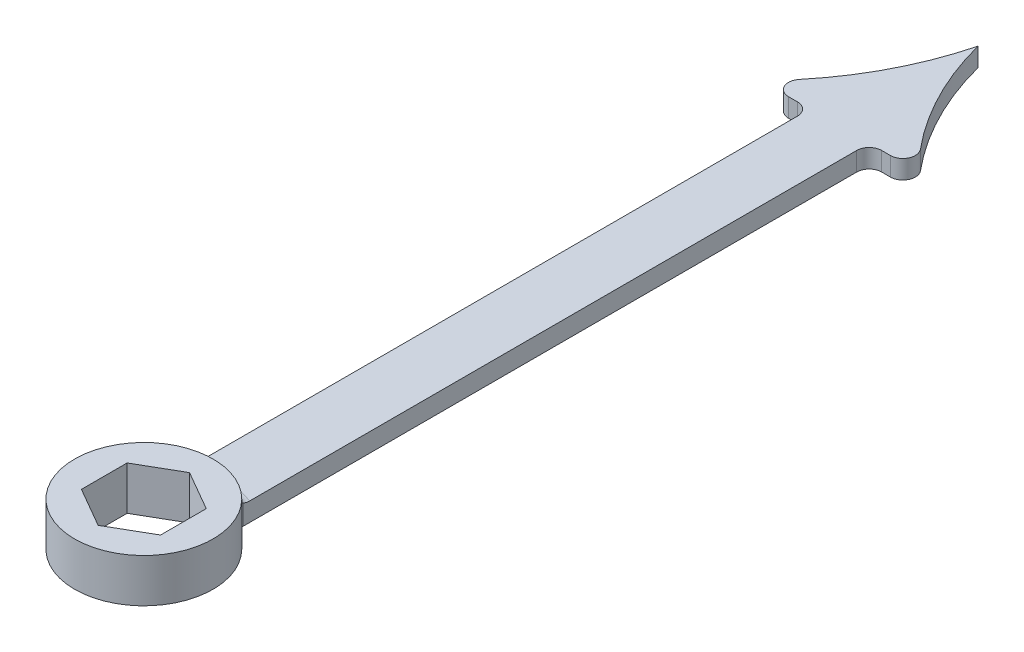
ISO-10303-21;
HEADER;
FILE_DESCRIPTION(('STEP AP214'),'2;1');
FILE_NAME('part.step','',(''),(''),'','','');
FILE_SCHEMA(('AUTOMOTIVE_DESIGN { 1 0 10303 214 1 1 1 1 }'));
ENDSEC;
DATA;
#1=APPLICATION_CONTEXT('core data for automotive mechanical design processes');
#2=APPLICATION_PROTOCOL_DEFINITION('international standard','automotive_design',2000,#1);
#3=PRODUCT_CONTEXT('',#1,'mechanical');
#4=PRODUCT('Part','Part','',(#3));
#5=PRODUCT_RELATED_PRODUCT_CATEGORY('part','',(#4));
#6=PRODUCT_DEFINITION_FORMATION('','',#4);
#7=PRODUCT_DEFINITION_CONTEXT('part definition',#1,'design');
#8=PRODUCT_DEFINITION('design','',#6,#7);
#9=PRODUCT_DEFINITION_SHAPE('','',#8);
#10=(LENGTH_UNIT() NAMED_UNIT(*) SI_UNIT(.MILLI.,.METRE.));
#11=(NAMED_UNIT(*) PLANE_ANGLE_UNIT() SI_UNIT($,.RADIAN.));
#12=(NAMED_UNIT(*) SI_UNIT($,.STERADIAN.) SOLID_ANGLE_UNIT());
#13=UNCERTAINTY_MEASURE_WITH_UNIT(LENGTH_MEASURE(1.E-05),#10,'distance_accuracy_value','');
#14=(GEOMETRIC_REPRESENTATION_CONTEXT(3) GLOBAL_UNCERTAINTY_ASSIGNED_CONTEXT((#13)) GLOBAL_UNIT_ASSIGNED_CONTEXT((#10,
#11,#12)) REPRESENTATION_CONTEXT('',''));
#15=CARTESIAN_POINT('',(0.,0.,0.));
#16=DIRECTION('',(0.,0.,1.));
#17=DIRECTION('',(1.,0.,0.));
#18=AXIS2_PLACEMENT_3D('',#15,#16,#17);
#19=CARTESIAN_POINT('',(0.,7.,0.));
#20=DIRECTION('',(0.,-1.,0.));
#21=DIRECTION('',(0.,0.,-1.));
#22=AXIS2_PLACEMENT_3D('',#19,#20,#21);
#23=CYLINDRICAL_SURFACE('',#22,11.1125);
#24=CARTESIAN_POINT('',(0.,7.,0.));
#25=DIRECTION('',(0.,1.,0.));
#26=DIRECTION('',(0.,0.,1.));
#27=AXIS2_PLACEMENT_3D('',#24,#25,#26);
#28=CIRCLE('',#27,11.1125);
#29=CARTESIAN_POINT('',(0.,7.,11.1125));
#30=VERTEX_POINT('',#29);
#31=EDGE_CURVE('E277',#30,#30,#28,.T.);
#32=ORIENTED_EDGE('',*,*,#31,.F.);
#33=EDGE_LOOP('',(#32));
#34=FACE_BOUND('',#33,.T.);
#35=CARTESIAN_POINT('',(0.,0.,0.));
#36=DIRECTION('',(0.,1.,0.));
#37=DIRECTION('',(0.,0.,1.));
#38=AXIS2_PLACEMENT_3D('',#35,#36,#37);
#39=CIRCLE('',#38,11.1125);
#40=CARTESIAN_POINT('',(-5.73104146806483,0.,-9.52065228549606));
#41=VERTEX_POINT('',#40);
#42=CARTESIAN_POINT('',(5.73104146806483,0.,-9.52065228549606));
#43=VERTEX_POINT('',#42);
#44=EDGE_CURVE('E276',#41,#43,#39,.T.);
#45=ORIENTED_EDGE('',*,*,#44,.T.);
#46=DIRECTION('',(0.,-1.,0.));
#47=VECTOR('',#46,1.);
#48=CARTESIAN_POINT('',(5.73104146806483,7.,-9.52065228549606));
#49=LINE('',#48,#47);
#50=CARTESIAN_POINT('',(5.73104146806483,5.,-9.52065228549606));
#51=VERTEX_POINT('',#50);
#52=EDGE_CURVE('E315',#43,#51,#49,.F.);
#53=ORIENTED_EDGE('',*,*,#52,.T.);
#54=CARTESIAN_POINT('',(0.,5.,0.));
#55=DIRECTION('',(0.,-1.,0.));
#56=DIRECTION('',(0.,0.,-1.));
#57=AXIS2_PLACEMENT_3D('',#54,#55,#56);
#58=CIRCLE('',#57,11.1125);
#59=CARTESIAN_POINT('',(-5.73104146806483,5.,-9.52065228549606));
#60=VERTEX_POINT('',#59);
#61=EDGE_CURVE('E313',#51,#60,#58,.F.);
#62=ORIENTED_EDGE('',*,*,#61,.T.);
#63=DIRECTION('',(0.,-1.,0.));
#64=VECTOR('',#63,1.);
#65=CARTESIAN_POINT('',(-5.73104146806483,7.,-9.52065228549606));
#66=LINE('',#65,#64);
#67=EDGE_CURVE('E311',#60,#41,#66,.T.);
#68=ORIENTED_EDGE('',*,*,#67,.T.);
#69=EDGE_LOOP('',(#45,#53,#62,#68));
#70=FACE_BOUND('',#69,.T.);
#71=ADVANCED_FACE('F37',(#34,#70),#23,.T.);
#72=CARTESIAN_POINT('',(0.,7.,0.));
#73=DIRECTION('',(0.,1.,0.));
#74=DIRECTION('',(0.,0.,1.));
#75=AXIS2_PLACEMENT_3D('',#72,#73,#74);
#76=PLANE('',#75);
#77=ORIENTED_EDGE('',*,*,#31,.T.);
#78=EDGE_LOOP('',(#77));
#79=FACE_BOUND('',#78,.T.);
#80=DIRECTION('',(-0.866025403784439,0.,-0.5));
#81=VECTOR('',#80,1.);
#82=CARTESIAN_POINT('',(6.35,7.,-3.66617420935412));
#83=LINE('',#82,#81);
#84=CARTESIAN_POINT('',(6.35,7.,-3.66617420935412));
#85=VERTEX_POINT('',#84);
#86=CARTESIAN_POINT('',(0.,7.,-7.33234841870825));
#87=VERTEX_POINT('',#86);
#88=EDGE_CURVE('E234',#85,#87,#83,.T.);
#89=ORIENTED_EDGE('',*,*,#88,.F.);
#90=DIRECTION('',(0.,0.,-1.));
#91=VECTOR('',#90,1.);
#92=CARTESIAN_POINT('',(6.35,7.,3.66617420935413));
#93=LINE('',#92,#91);
#94=CARTESIAN_POINT('',(6.35,7.,3.66617420935413));
#95=VERTEX_POINT('',#94);
#96=EDGE_CURVE('E232',#95,#85,#93,.T.);
#97=ORIENTED_EDGE('',*,*,#96,.F.);
#98=DIRECTION('',(0.866025403784439,0.,-0.5));
#99=VECTOR('',#98,1.);
#100=CARTESIAN_POINT('',(0.,7.,7.33234841870825));
#101=LINE('',#100,#99);
#102=CARTESIAN_POINT('',(0.,7.,7.33234841870825));
#103=VERTEX_POINT('',#102);
#104=EDGE_CURVE('E244',#103,#95,#101,.T.);
#105=ORIENTED_EDGE('',*,*,#104,.F.);
#106=DIRECTION('',(0.866025403784438,0.,0.5));
#107=VECTOR('',#106,1.);
#108=CARTESIAN_POINT('',(-6.35,7.,3.66617420935412));
#109=LINE('',#108,#107);
#110=CARTESIAN_POINT('',(-6.35,7.,3.66617420935412));
#111=VERTEX_POINT('',#110);
#112=EDGE_CURVE('E241',#111,#103,#109,.T.);
#113=ORIENTED_EDGE('',*,*,#112,.F.);
#114=DIRECTION('',(0.,0.,1.));
#115=VECTOR('',#114,1.);
#116=CARTESIAN_POINT('',(-6.35,7.,-3.66617420935413));
#117=LINE('',#116,#115);
#118=CARTESIAN_POINT('',(-6.35,7.,-3.66617420935413));
#119=VERTEX_POINT('',#118);
#120=EDGE_CURVE('E239',#119,#111,#117,.T.);
#121=ORIENTED_EDGE('',*,*,#120,.F.);
#122=DIRECTION('',(-0.866025403784439,0.,0.5));
#123=VECTOR('',#122,1.);
#124=CARTESIAN_POINT('',(0.,7.,-7.33234841870825));
#125=LINE('',#124,#123);
#126=EDGE_CURVE('E237',#87,#119,#125,.T.);
#127=ORIENTED_EDGE('',*,*,#126,.F.);
#128=EDGE_LOOP('',(#89,#97,#105,#113,#121,#127));
#129=FACE_BOUND('',#128,.T.);
#130=ADVANCED_FACE('F419',(#79,#129),#76,.T.);
#131=CARTESIAN_POINT('',(0.,0.,0.));
#132=DIRECTION('',(0.,1.,0.));
#133=DIRECTION('',(0.,0.,1.));
#134=AXIS2_PLACEMENT_3D('',#131,#132,#133);
#135=PLANE('',#134);
#136=DIRECTION('',(1.,0.,0.));
#137=VECTOR('',#136,1.);
#138=CARTESIAN_POINT('',(-4.7625,0.,-111.640231571035));
#139=LINE('',#138,#137);
#140=CARTESIAN_POINT('',(-8.16989211177416,0.,-111.640231571035));
#141=VERTEX_POINT('',#140);
#142=CARTESIAN_POINT('',(-6.7625,0.,-111.640231571035));
#143=VERTEX_POINT('',#142);
#144=EDGE_CURVE('E228',#141,#143,#139,.T.);
#145=ORIENTED_EDGE('',*,*,#144,.F.);
#146=CARTESIAN_POINT('',(-8.16989211177416,0.,-113.640231571035));
#147=DIRECTION('',(0.,1.,0.));
#148=DIRECTION('',(0.,0.,1.));
#149=AXIS2_PLACEMENT_3D('',#146,#147,#148);
#150=CIRCLE('',#149,2.);
#151=CARTESIAN_POINT('',(-9.70715885046328,0.,-114.919610707225));
#152=VERTEX_POINT('',#151);
#153=EDGE_CURVE('E289',#141,#152,#150,.F.);
#154=ORIENTED_EDGE('',*,*,#153,.T.);
#155=CARTESIAN_POINT('',(-47.0958333333334,0.,-146.036064904368));
#156=DIRECTION('',(0.,-1.,0.));
#157=DIRECTION('',(0.,0.,1.));
#158=AXIS2_PLACEMENT_3D('',#155,#156,#157);
#159=CIRCLE('',#158,48.6430539891246);
#160=CARTESIAN_POINT('',(0.,0.,-133.865231571035));
#161=VERTEX_POINT('',#160);
#162=EDGE_CURVE('E226',#161,#152,#159,.T.);
#163=ORIENTED_EDGE('',*,*,#162,.F.);
#164=CARTESIAN_POINT('',(47.0958333333334,0.,-146.036064904368));
#165=DIRECTION('',(0.,-1.,0.));
#166=DIRECTION('',(0.,0.,-1.));
#167=AXIS2_PLACEMENT_3D('',#164,#165,#166);
#168=CIRCLE('',#167,48.6430539891246);
#169=CARTESIAN_POINT('',(9.70715885046329,0.,-114.919610707225));
#170=VERTEX_POINT('',#169);
#171=EDGE_CURVE('E200',#170,#161,#168,.T.);
#172=ORIENTED_EDGE('',*,*,#171,.F.);
#173=CARTESIAN_POINT('',(8.16989211177417,0.,-113.640231571035));
#174=DIRECTION('',(0.,1.,0.));
#175=DIRECTION('',(0.,0.,1.));
#176=AXIS2_PLACEMENT_3D('',#173,#174,#175);
#177=CIRCLE('',#176,2.);
#178=CARTESIAN_POINT('',(8.16989211177417,0.,-111.640231571035));
#179=VERTEX_POINT('',#178);
#180=EDGE_CURVE('E287',#170,#179,#177,.F.);
#181=ORIENTED_EDGE('',*,*,#180,.T.);
#182=DIRECTION('',(1.,0.,0.));
#183=VECTOR('',#182,1.);
#184=CARTESIAN_POINT('',(12.7,0.,-111.640231571035));
#185=LINE('',#184,#183);
#186=CARTESIAN_POINT('',(6.7625,0.,-111.640231571035));
#187=VERTEX_POINT('',#186);
#188=EDGE_CURVE('E222',#187,#179,#185,.T.);
#189=ORIENTED_EDGE('',*,*,#188,.F.);
#190=CARTESIAN_POINT('',(6.7625,0.,-109.640231571035));
#191=DIRECTION('',(0.,1.,0.));
#192=DIRECTION('',(0.,0.,1.));
#193=AXIS2_PLACEMENT_3D('',#190,#191,#192);
#194=CIRCLE('',#193,2.);
#195=CARTESIAN_POINT('',(4.7625,0.,-109.640231571035));
#196=VERTEX_POINT('',#195);
#197=EDGE_CURVE('E317',#187,#196,#194,.T.);
#198=ORIENTED_EDGE('',*,*,#197,.T.);
#199=DIRECTION('',(0.,0.,-1.));
#200=VECTOR('',#199,1.);
#201=CARTESIAN_POINT('',(4.7625,0.,-111.640231571035));
#202=LINE('',#201,#200);
#203=CARTESIAN_POINT('',(4.76250000000001,0.,-11.2341555089824));
#204=VERTEX_POINT('',#203);
#205=EDGE_CURVE('E218',#204,#196,#202,.T.);
#206=ORIENTED_EDGE('',*,*,#205,.F.);
#207=CARTESIAN_POINT('',(6.76250000000001,0.,-11.2341555089824));
#208=DIRECTION('',(0.,1.,0.));
#209=DIRECTION('',(0.,0.,1.));
#210=AXIS2_PLACEMENT_3D('',#207,#208,#209);
#211=CIRCLE('',#210,2.);
#212=EDGE_CURVE('E325',#204,#43,#211,.T.);
#213=ORIENTED_EDGE('',*,*,#212,.T.);
#214=ORIENTED_EDGE('',*,*,#44,.F.);
#215=CARTESIAN_POINT('',(-6.76250000000001,0.,-11.2341555089824));
#216=DIRECTION('',(0.,1.,0.));
#217=DIRECTION('',(0.,0.,1.));
#218=AXIS2_PLACEMENT_3D('',#215,#216,#217);
#219=CIRCLE('',#218,2.);
#220=CARTESIAN_POINT('',(-4.76250000000001,0.,-11.2341555089824));
#221=VERTEX_POINT('',#220);
#222=EDGE_CURVE('E11',#41,#221,#219,.T.);
#223=ORIENTED_EDGE('',*,*,#222,.T.);
#224=DIRECTION('',(0.,0.,1.));
#225=VECTOR('',#224,1.);
#226=CARTESIAN_POINT('',(-4.7625,0.,-111.640231571035));
#227=LINE('',#226,#225);
#228=CARTESIAN_POINT('',(-4.7625,0.,-109.640231571035));
#229=VERTEX_POINT('',#228);
#230=EDGE_CURVE('E215',#229,#221,#227,.T.);
#231=ORIENTED_EDGE('',*,*,#230,.F.);
#232=CARTESIAN_POINT('',(-6.7625,0.,-109.640231571035));
#233=DIRECTION('',(0.,1.,0.));
#234=DIRECTION('',(0.,0.,1.));
#235=AXIS2_PLACEMENT_3D('',#232,#233,#234);
#236=CIRCLE('',#235,2.);
#237=EDGE_CURVE('E321',#229,#143,#236,.T.);
#238=ORIENTED_EDGE('',*,*,#237,.T.);
#239=EDGE_LOOP('',(#145,#154,#163,#172,#181,#189,#198,#206,#213,#214,#223,#231,#238));
#240=FACE_BOUND('',#239,.T.);
#241=DIRECTION('',(0.,0.,-1.));
#242=VECTOR('',#241,1.);
#243=CARTESIAN_POINT('',(6.35,0.,3.66617420935413));
#244=LINE('',#243,#242);
#245=CARTESIAN_POINT('',(6.35,0.,3.66617420935413));
#246=VERTEX_POINT('',#245);
#247=CARTESIAN_POINT('',(6.35,0.,-3.66617420935412));
#248=VERTEX_POINT('',#247);
#249=EDGE_CURVE('E204',#246,#248,#244,.T.);
#250=ORIENTED_EDGE('',*,*,#249,.T.);
#251=DIRECTION('',(-0.866025403784439,0.,-0.5));
#252=VECTOR('',#251,1.);
#253=CARTESIAN_POINT('',(6.35,0.,-3.66617420935412));
#254=LINE('',#253,#252);
#255=CARTESIAN_POINT('',(0.,0.,-7.33234841870825));
#256=VERTEX_POINT('',#255);
#257=EDGE_CURVE('E249',#248,#256,#254,.T.);
#258=ORIENTED_EDGE('',*,*,#257,.T.);
#259=DIRECTION('',(-0.866025403784439,0.,0.5));
#260=VECTOR('',#259,1.);
#261=CARTESIAN_POINT('',(0.,0.,-7.33234841870825));
#262=LINE('',#261,#260);
#263=CARTESIAN_POINT('',(-6.35,0.,-3.66617420935413));
#264=VERTEX_POINT('',#263);
#265=EDGE_CURVE('E252',#256,#264,#262,.T.);
#266=ORIENTED_EDGE('',*,*,#265,.T.);
#267=DIRECTION('',(0.,0.,1.));
#268=VECTOR('',#267,1.);
#269=CARTESIAN_POINT('',(-6.35,0.,-3.66617420935413));
#270=LINE('',#269,#268);
#271=CARTESIAN_POINT('',(-6.35,0.,3.66617420935412));
#272=VERTEX_POINT('',#271);
#273=EDGE_CURVE('E255',#264,#272,#270,.T.);
#274=ORIENTED_EDGE('',*,*,#273,.T.);
#275=DIRECTION('',(0.866025403784438,0.,0.5));
#276=VECTOR('',#275,1.);
#277=CARTESIAN_POINT('',(-6.35,0.,3.66617420935412));
#278=LINE('',#277,#276);
#279=CARTESIAN_POINT('',(0.,0.,7.33234841870825));
#280=VERTEX_POINT('',#279);
#281=EDGE_CURVE('E258',#272,#280,#278,.T.);
#282=ORIENTED_EDGE('',*,*,#281,.T.);
#283=DIRECTION('',(0.866025403784439,0.,-0.5));
#284=VECTOR('',#283,1.);
#285=CARTESIAN_POINT('',(0.,0.,7.33234841870825));
#286=LINE('',#285,#284);
#287=EDGE_CURVE('E235',#280,#246,#286,.T.);
#288=ORIENTED_EDGE('',*,*,#287,.T.);
#289=EDGE_LOOP('',(#250,#258,#266,#274,#282,#288));
#290=FACE_BOUND('',#289,.T.);
#291=ADVANCED_FACE('F371',(#240,#290),#135,.F.);
#292=CARTESIAN_POINT('',(6.35,7.,3.66617420935413));
#293=DIRECTION('',(-1.,0.,0.));
#294=DIRECTION('',(0.,0.,1.));
#295=AXIS2_PLACEMENT_3D('',#292,#293,#294);
#296=PLANE('',#295);
#297=ORIENTED_EDGE('',*,*,#249,.F.);
#298=DIRECTION('',(0.,-1.,0.));
#299=VECTOR('',#298,1.);
#300=CARTESIAN_POINT('',(6.35,7.,3.66617420935413));
#301=LINE('',#300,#299);
#302=EDGE_CURVE('E246',#95,#246,#301,.T.);
#303=ORIENTED_EDGE('',*,*,#302,.F.);
#304=ORIENTED_EDGE('',*,*,#96,.T.);
#305=DIRECTION('',(0.,-1.,0.));
#306=VECTOR('',#305,1.);
#307=CARTESIAN_POINT('',(6.35,7.,-3.66617420935412));
#308=LINE('',#307,#306);
#309=EDGE_CURVE('E273',#85,#248,#308,.T.);
#310=ORIENTED_EDGE('',*,*,#309,.T.);
#311=EDGE_LOOP('',(#297,#303,#304,#310));
#312=FACE_BOUND('',#311,.T.);
#313=ADVANCED_FACE('F531',(#312),#296,.T.);
#314=CARTESIAN_POINT('',(6.35,7.,-3.66617420935412));
#315=DIRECTION('',(-0.5,0.,0.866025403784439));
#316=DIRECTION('',(0.866025403784439,0.,0.5));
#317=AXIS2_PLACEMENT_3D('',#314,#315,#316);
#318=PLANE('',#317);
#319=ORIENTED_EDGE('',*,*,#257,.F.);
#320=ORIENTED_EDGE('',*,*,#309,.F.);
#321=ORIENTED_EDGE('',*,*,#88,.T.);
#322=DIRECTION('',(0.,-1.,0.));
#323=VECTOR('',#322,1.);
#324=CARTESIAN_POINT('',(0.,7.,-7.33234841870825));
#325=LINE('',#324,#323);
#326=EDGE_CURVE('E271',#87,#256,#325,.T.);
#327=ORIENTED_EDGE('',*,*,#326,.T.);
#328=EDGE_LOOP('',(#319,#320,#321,#327));
#329=FACE_BOUND('',#328,.T.);
#330=ADVANCED_FACE('F570',(#329),#318,.T.);
#331=CARTESIAN_POINT('',(0.,7.,-7.33234841870825));
#332=DIRECTION('',(0.5,0.,0.866025403784439));
#333=DIRECTION('',(0.866025403784439,0.,-0.5));
#334=AXIS2_PLACEMENT_3D('',#331,#332,#333);
#335=PLANE('',#334);
#336=ORIENTED_EDGE('',*,*,#265,.F.);
#337=ORIENTED_EDGE('',*,*,#326,.F.);
#338=ORIENTED_EDGE('',*,*,#126,.T.);
#339=DIRECTION('',(0.,-1.,0.));
#340=VECTOR('',#339,1.);
#341=CARTESIAN_POINT('',(-6.35,7.,-3.66617420935413));
#342=LINE('',#341,#340);
#343=EDGE_CURVE('E269',#119,#264,#342,.T.);
#344=ORIENTED_EDGE('',*,*,#343,.T.);
#345=EDGE_LOOP('',(#336,#337,#338,#344));
#346=FACE_BOUND('',#345,.T.);
#347=ADVANCED_FACE('F561',(#346),#335,.T.);
#348=CARTESIAN_POINT('',(-6.35,7.,-3.66617420935413));
#349=DIRECTION('',(1.,0.,0.));
#350=DIRECTION('',(0.,0.,-1.));
#351=AXIS2_PLACEMENT_3D('',#348,#349,#350);
#352=PLANE('',#351);
#353=ORIENTED_EDGE('',*,*,#273,.F.);
#354=ORIENTED_EDGE('',*,*,#343,.F.);
#355=ORIENTED_EDGE('',*,*,#120,.T.);
#356=DIRECTION('',(0.,-1.,0.));
#357=VECTOR('',#356,1.);
#358=CARTESIAN_POINT('',(-6.35,7.,3.66617420935412));
#359=LINE('',#358,#357);
#360=EDGE_CURVE('E267',#111,#272,#359,.T.);
#361=ORIENTED_EDGE('',*,*,#360,.T.);
#362=EDGE_LOOP('',(#353,#354,#355,#361));
#363=FACE_BOUND('',#362,.T.);
#364=ADVANCED_FACE('F552',(#363),#352,.T.);
#365=CARTESIAN_POINT('',(-6.35,7.,3.66617420935412));
#366=DIRECTION('',(0.5,0.,-0.866025403784438));
#367=DIRECTION('',(-0.866025403784439,0.,-0.5));
#368=AXIS2_PLACEMENT_3D('',#365,#366,#367);
#369=PLANE('',#368);
#370=ORIENTED_EDGE('',*,*,#281,.F.);
#371=ORIENTED_EDGE('',*,*,#360,.F.);
#372=ORIENTED_EDGE('',*,*,#112,.T.);
#373=DIRECTION('',(0.,-1.,0.));
#374=VECTOR('',#373,1.);
#375=CARTESIAN_POINT('',(0.,7.,7.33234841870825));
#376=LINE('',#375,#374);
#377=EDGE_CURVE('E265',#103,#280,#376,.T.);
#378=ORIENTED_EDGE('',*,*,#377,.T.);
#379=EDGE_LOOP('',(#370,#371,#372,#378));
#380=FACE_BOUND('',#379,.T.);
#381=ADVANCED_FACE('F414',(#380),#369,.T.);
#382=CARTESIAN_POINT('',(0.,7.,7.33234841870825));
#383=DIRECTION('',(-0.5,0.,-0.866025403784439));
#384=DIRECTION('',(-0.866025403784439,0.,0.5));
#385=AXIS2_PLACEMENT_3D('',#382,#383,#384);
#386=PLANE('',#385);
#387=ORIENTED_EDGE('',*,*,#287,.F.);
#388=ORIENTED_EDGE('',*,*,#377,.F.);
#389=ORIENTED_EDGE('',*,*,#104,.T.);
#390=ORIENTED_EDGE('',*,*,#302,.T.);
#391=EDGE_LOOP('',(#387,#388,#389,#390));
#392=FACE_BOUND('',#391,.T.);
#393=ADVANCED_FACE('F408',(#392),#386,.T.);
#394=CARTESIAN_POINT('',(-4.7625,3.,-111.640231571035));
#395=DIRECTION('',(1.,0.,0.));
#396=DIRECTION('',(0.,0.,-1.));
#397=AXIS2_PLACEMENT_3D('',#394,#395,#396);
#398=PLANE('',#397);
#399=DIRECTION('',(0.,0.,1.));
#400=VECTOR('',#399,1.);
#401=CARTESIAN_POINT('',(-4.7625,3.,-111.640231571035));
#402=LINE('',#401,#400);
#403=CARTESIAN_POINT('',(-4.7625,3.,-109.640231571035));
#404=VERTEX_POINT('',#403);
#405=CARTESIAN_POINT('',(-4.76250000000001,3.,-12.2170475156643));
#406=VERTEX_POINT('',#405);
#407=EDGE_CURVE('E230',#404,#406,#402,.T.);
#408=ORIENTED_EDGE('',*,*,#407,.F.);
#409=DIRECTION('',(0.,-1.,0.));
#410=VECTOR('',#409,1.);
#411=CARTESIAN_POINT('',(-4.7625,0.,-109.640231571035));
#412=LINE('',#411,#410);
#413=EDGE_CURVE('E308',#404,#229,#412,.T.);
#414=ORIENTED_EDGE('',*,*,#413,.T.);
#415=ORIENTED_EDGE('',*,*,#230,.T.);
#416=DIRECTION('',(0.,1.,0.));
#417=VECTOR('',#416,1.);
#418=CARTESIAN_POINT('',(-4.76250000000001,3.,-11.2341555089824));
#419=LINE('',#418,#417);
#420=CARTESIAN_POINT('',(-4.76250000000001,3.21929673899231,-11.2341555089824));
#421=VERTEX_POINT('',#420);
#422=EDGE_CURVE('E59',#221,#421,#419,.T.);
#423=ORIENTED_EDGE('',*,*,#422,.T.);
#424=CARTESIAN_POINT('',(-4.76250000000001,3.21929673899231,-11.2341555089824));
#425=CARTESIAN_POINT('',(-4.76250000000001,3.1914096548871,-11.2934044567039));
#426=CARTESIAN_POINT('',(-4.76250000000001,3.16609121998151,-11.3538197357716));
#427=CARTESIAN_POINT('',(-4.76250000000001,3.12069964349236,-11.4765963763193));
#428=CARTESIAN_POINT('',(-4.76250000000001,3.10062697968031,-11.538957914481));
#429=CARTESIAN_POINT('',(-4.76250000000001,3.04910814252754,-11.725964070257));
#430=CARTESIAN_POINT('',(-4.76250000000001,3.02529585007529,-11.8528148668332));
#431=CARTESIAN_POINT('',(-4.76250000000001,3.00404156504719,-12.0592370611826));
#432=CARTESIAN_POINT('',(-4.76250000000001,2.9999721340328,-12.1381805718689));
#433=CARTESIAN_POINT('',(-4.76250000000001,3.,-12.2170475156643));
#434=B_SPLINE_CURVE_WITH_KNOTS('',3,(#424,#425,#426,#427,#428,#429,#430,#431,#432,#433),
.UNSPECIFIED.,.F.,.F.,(4,2,2,2,4),(0.,0.196315726662677,0.392649327037512,0.777849154855152,
1.01453335750729),.UNSPECIFIED.);
#435=EDGE_CURVE('E51',#421,#406,#434,.T.);
#436=ORIENTED_EDGE('',*,*,#435,.T.);
#437=EDGE_LOOP('',(#408,#414,#415,#423,#436));
#438=FACE_BOUND('',#437,.T.);
#439=ADVANCED_FACE('F406',(#438),#398,.F.);
#440=CARTESIAN_POINT('',(4.7625,3.,-111.640231571035));
#441=DIRECTION('',(-1.,0.,0.));
#442=DIRECTION('',(0.,0.,1.));
#443=AXIS2_PLACEMENT_3D('',#440,#441,#442);
#444=PLANE('',#443);
#445=ORIENTED_EDGE('',*,*,#205,.T.);
#446=DIRECTION('',(0.,-1.,0.));
#447=VECTOR('',#446,1.);
#448=CARTESIAN_POINT('',(4.7625,3.,-109.640231571035));
#449=LINE('',#448,#447);
#450=CARTESIAN_POINT('',(4.7625,3.,-109.640231571035));
#451=VERTEX_POINT('',#450);
#452=EDGE_CURVE('E305',#196,#451,#449,.F.);
#453=ORIENTED_EDGE('',*,*,#452,.T.);
#454=DIRECTION('',(0.,0.,-1.));
#455=VECTOR('',#454,1.);
#456=CARTESIAN_POINT('',(4.7625,3.,-111.640231571035));
#457=LINE('',#456,#455);
#458=CARTESIAN_POINT('',(4.76250000000001,3.,-12.2170475156643));
#459=VERTEX_POINT('',#458);
#460=EDGE_CURVE('E380',#459,#451,#457,.T.);
#461=ORIENTED_EDGE('',*,*,#460,.F.);
#462=CARTESIAN_POINT('',(4.76250000000001,3.,-12.2170475156643));
#463=CARTESIAN_POINT('',(4.76250000000001,3.00000646734998,-12.1515698078484));
#464=CARTESIAN_POINT('',(4.76250000000001,3.00279369054526,-12.0861405231735));
#465=CARTESIAN_POINT('',(4.76250000000001,3.01389966317298,-11.9557170658602));
#466=CARTESIAN_POINT('',(4.76250000000001,3.02222143537952,-11.8907231506095));
#467=CARTESIAN_POINT('',(4.76250000000001,3.0550113916884,-11.6995034250665));
#468=CARTESIAN_POINT('',(4.76250000000001,3.08731100363365,-11.5744815940641));
#469=CARTESIAN_POINT('',(4.76250000000001,3.14271593282629,-11.4160689565287));
#470=CARTESIAN_POINT('',(4.76250000000001,3.15666192605536,-11.3792633454311));
#471=CARTESIAN_POINT('',(4.76250000000001,3.18651705373608,-11.3062144427257));
#472=CARTESIAN_POINT('',(4.76250000000001,3.20243683200571,-11.2699755016664));
#473=CARTESIAN_POINT('',(4.76250000000001,3.21929673899231,-11.2341555089824));
#474=B_SPLINE_CURVE_WITH_KNOTS('',3,(#462,#463,#464,#465,#466,#467,#468,#469,#470,#471,#472,
#473),.UNSPECIFIED.,.F.,.F.,(4,2,2,2,2,4),(0.,0.196278388849445,0.392664066114746,
0.777852160008767,0.89589803817589,1.01461069648536),.UNSPECIFIED.);
#475=CARTESIAN_POINT('',(4.76250000000001,3.21929673899231,-11.2341555089824));
#476=VERTEX_POINT('',#475);
#477=EDGE_CURVE('E327',#459,#476,#474,.T.);
#478=ORIENTED_EDGE('',*,*,#477,.T.);
#479=DIRECTION('',(0.,1.,0.));
#480=VECTOR('',#479,1.);
#481=CARTESIAN_POINT('',(4.76250000000001,0.,-11.2341555089824));
#482=LINE('',#481,#480);
#483=EDGE_CURVE('E67',#476,#204,#482,.F.);
#484=ORIENTED_EDGE('',*,*,#483,.T.);
#485=EDGE_LOOP('',(#445,#453,#461,#478,#484));
#486=FACE_BOUND('',#485,.T.);
#487=ADVANCED_FACE('F339',(#486),#444,.F.);
#488=CARTESIAN_POINT('',(12.7,3.,-111.640231571035));
#489=DIRECTION('',(0.,0.,-1.));
#490=DIRECTION('',(-1.,0.,0.));
#491=AXIS2_PLACEMENT_3D('',#488,#489,#490);
#492=PLANE('',#491);
#493=ORIENTED_EDGE('',*,*,#188,.T.);
#494=DIRECTION('',(0.,-1.,0.));
#495=VECTOR('',#494,1.);
#496=CARTESIAN_POINT('',(8.16989211177417,3.,-111.640231571035));
#497=LINE('',#496,#495);
#498=CARTESIAN_POINT('',(8.16989211177417,3.,-111.640231571035));
#499=VERTEX_POINT('',#498);
#500=EDGE_CURVE('E302',#179,#499,#497,.F.);
#501=ORIENTED_EDGE('',*,*,#500,.T.);
#502=DIRECTION('',(1.,0.,0.));
#503=VECTOR('',#502,1.);
#504=CARTESIAN_POINT('',(12.7,3.,-111.640231571035));
#505=LINE('',#504,#503);
#506=CARTESIAN_POINT('',(6.7625,3.,-111.640231571035));
#507=VERTEX_POINT('',#506);
#508=EDGE_CURVE('E194',#507,#499,#505,.T.);
#509=ORIENTED_EDGE('',*,*,#508,.F.);
#510=DIRECTION('',(0.,-1.,0.));
#511=VECTOR('',#510,1.);
#512=CARTESIAN_POINT('',(6.7625,0.,-111.640231571035));
#513=LINE('',#512,#511);
#514=EDGE_CURVE('E299',#507,#187,#513,.T.);
#515=ORIENTED_EDGE('',*,*,#514,.T.);
#516=EDGE_LOOP('',(#493,#501,#509,#515));
#517=FACE_BOUND('',#516,.T.);
#518=ADVANCED_FACE('F413',(#517),#492,.F.);
#519=CARTESIAN_POINT('',(47.0958333333334,3.,-146.036064904368));
#520=DIRECTION('',(0.,-1.,0.));
#521=DIRECTION('',(0.,0.,-1.));
#522=AXIS2_PLACEMENT_3D('',#519,#520,#521);
#523=CYLINDRICAL_SURFACE('',#522,48.6430539891246);
#524=CARTESIAN_POINT('',(47.0958333333334,3.,-146.036064904368));
#525=DIRECTION('',(0.,-1.,0.));
#526=DIRECTION('',(0.,0.,-1.));
#527=AXIS2_PLACEMENT_3D('',#524,#525,#526);
#528=CIRCLE('',#527,48.6430539891246);
#529=CARTESIAN_POINT('',(9.70715885046329,3.,-114.919610707225));
#530=VERTEX_POINT('',#529);
#531=CARTESIAN_POINT('',(0.,3.,-133.865231571035));
#532=VERTEX_POINT('',#531);
#533=EDGE_CURVE('E182',#530,#532,#528,.T.);
#534=ORIENTED_EDGE('',*,*,#533,.F.);
#535=DIRECTION('',(0.,-1.,0.));
#536=VECTOR('',#535,1.);
#537=CARTESIAN_POINT('',(9.70715885046328,3.,-114.919610707225));
#538=LINE('',#537,#536);
#539=EDGE_CURVE('E297',#530,#170,#538,.T.);
#540=ORIENTED_EDGE('',*,*,#539,.T.);
#541=ORIENTED_EDGE('',*,*,#171,.T.);
#542=DIRECTION('',(0.,-1.,0.));
#543=VECTOR('',#542,1.);
#544=CARTESIAN_POINT('',(0.,3.,-133.865231571035));
#545=LINE('',#544,#543);
#546=EDGE_CURVE('E197',#532,#161,#545,.T.);
#547=ORIENTED_EDGE('',*,*,#546,.F.);
#548=EDGE_LOOP('',(#534,#540,#541,#547));
#549=FACE_BOUND('',#548,.T.);
#550=ADVANCED_FACE('F198',(#549),#523,.F.);
#551=CARTESIAN_POINT('',(-47.0958333333334,3.,-146.036064904368));
#552=DIRECTION('',(0.,-1.,0.));
#553=DIRECTION('',(0.,0.,-1.));
#554=AXIS2_PLACEMENT_3D('',#551,#552,#553);
#555=CYLINDRICAL_SURFACE('',#554,48.6430539891246);
#556=ORIENTED_EDGE('',*,*,#162,.T.);
#557=DIRECTION('',(0.,-1.,0.));
#558=VECTOR('',#557,1.);
#559=CARTESIAN_POINT('',(-9.70715885046328,3.,-114.919610707225));
#560=LINE('',#559,#558);
#561=CARTESIAN_POINT('',(-9.70715885046328,3.,-114.919610707225));
#562=VERTEX_POINT('',#561);
#563=EDGE_CURVE('E209',#152,#562,#560,.F.);
#564=ORIENTED_EDGE('',*,*,#563,.T.);
#565=CARTESIAN_POINT('',(-47.0958333333334,3.,-146.036064904368));
#566=DIRECTION('',(0.,-1.,0.));
#567=DIRECTION('',(0.,0.,1.));
#568=AXIS2_PLACEMENT_3D('',#565,#566,#567);
#569=CIRCLE('',#568,48.6430539891246);
#570=EDGE_CURVE('E186',#532,#562,#569,.T.);
#571=ORIENTED_EDGE('',*,*,#570,.F.);
#572=ORIENTED_EDGE('',*,*,#546,.T.);
#573=EDGE_LOOP('',(#556,#564,#571,#572));
#574=FACE_BOUND('',#573,.T.);
#575=ADVANCED_FACE('F207',(#574),#555,.F.);
#576=CARTESIAN_POINT('',(-4.7625,3.,-111.640231571035));
#577=DIRECTION('',(0.,0.,-1.));
#578=DIRECTION('',(-1.,0.,0.));
#579=AXIS2_PLACEMENT_3D('',#576,#577,#578);
#580=PLANE('',#579);
#581=DIRECTION('',(1.,0.,0.));
#582=VECTOR('',#581,1.);
#583=CARTESIAN_POINT('',(-4.7625,3.,-111.640231571035));
#584=LINE('',#583,#582);
#585=CARTESIAN_POINT('',(-8.16989211177416,3.,-111.640231571035));
#586=VERTEX_POINT('',#585);
#587=CARTESIAN_POINT('',(-6.7625,3.,-111.640231571035));
#588=VERTEX_POINT('',#587);
#589=EDGE_CURVE('E205',#586,#588,#584,.T.);
#590=ORIENTED_EDGE('',*,*,#589,.F.);
#591=DIRECTION('',(0.,-1.,0.));
#592=VECTOR('',#591,1.);
#593=CARTESIAN_POINT('',(-8.16989211177416,3.,-111.640231571035));
#594=LINE('',#593,#592);
#595=EDGE_CURVE('E284',#586,#141,#594,.T.);
#596=ORIENTED_EDGE('',*,*,#595,.T.);
#597=ORIENTED_EDGE('',*,*,#144,.T.);
#598=DIRECTION('',(0.,-1.,0.));
#599=VECTOR('',#598,1.);
#600=CARTESIAN_POINT('',(-6.7625,3.,-111.640231571035));
#601=LINE('',#600,#599);
#602=EDGE_CURVE('E280',#143,#588,#601,.F.);
#603=ORIENTED_EDGE('',*,*,#602,.T.);
#604=EDGE_LOOP('',(#590,#596,#597,#603));
#605=FACE_BOUND('',#604,.T.);
#606=ADVANCED_FACE('F402',(#605),#580,.F.);
#607=CARTESIAN_POINT('',(47.0958333333334,3.,-146.036064904368));
#608=DIRECTION('',(0.,-1.,0.));
#609=DIRECTION('',(0.,0.,-1.));
#610=AXIS2_PLACEMENT_3D('',#607,#608,#609);
#611=PLANE('',#610);
#612=ORIENTED_EDGE('',*,*,#570,.T.);
#613=CARTESIAN_POINT('',(-8.16989211177416,3.,-113.640231571035));
#614=DIRECTION('',(0.,-1.,0.));
#615=DIRECTION('',(0.,0.,-1.));
#616=AXIS2_PLACEMENT_3D('',#613,#614,#615);
#617=CIRCLE('',#616,2.);
#618=EDGE_CURVE('E295',#562,#586,#617,.F.);
#619=ORIENTED_EDGE('',*,*,#618,.T.);
#620=ORIENTED_EDGE('',*,*,#589,.T.);
#621=CARTESIAN_POINT('',(-6.7625,3.,-109.640231571035));
#622=DIRECTION('',(0.,-1.,0.));
#623=DIRECTION('',(0.,0.,-1.));
#624=AXIS2_PLACEMENT_3D('',#621,#622,#623);
#625=CIRCLE('',#624,2.);
#626=EDGE_CURVE('E323',#588,#404,#625,.T.);
#627=ORIENTED_EDGE('',*,*,#626,.T.);
#628=ORIENTED_EDGE('',*,*,#407,.T.);
#629=CARTESIAN_POINT('',(0.,3.,0.));
#630=DIRECTION('',(0.,-1.,0.));
#631=DIRECTION('',(0.,0.,-1.));
#632=AXIS2_PLACEMENT_3D('',#629,#630,#631);
#633=CIRCLE('',#632,13.1125);
#634=EDGE_CURVE('E292',#406,#459,#633,.T.);
#635=ORIENTED_EDGE('',*,*,#634,.T.);
#636=ORIENTED_EDGE('',*,*,#460,.T.);
#637=CARTESIAN_POINT('',(6.7625,3.,-109.640231571035));
#638=DIRECTION('',(0.,-1.,0.));
#639=DIRECTION('',(0.,0.,-1.));
#640=AXIS2_PLACEMENT_3D('',#637,#638,#639);
#641=CIRCLE('',#640,2.);
#642=EDGE_CURVE('E319',#451,#507,#641,.T.);
#643=ORIENTED_EDGE('',*,*,#642,.T.);
#644=ORIENTED_EDGE('',*,*,#508,.T.);
#645=CARTESIAN_POINT('',(8.16989211177417,3.,-113.640231571035));
#646=DIRECTION('',(0.,-1.,0.));
#647=DIRECTION('',(0.,0.,-1.));
#648=AXIS2_PLACEMENT_3D('',#645,#646,#647);
#649=CIRCLE('',#648,2.);
#650=EDGE_CURVE('E190',#499,#530,#649,.F.);
#651=ORIENTED_EDGE('',*,*,#650,.T.);
#652=ORIENTED_EDGE('',*,*,#533,.T.);
#653=EDGE_LOOP('',(#612,#619,#620,#627,#628,#635,#636,#643,#644,#651,#652));
#654=FACE_BOUND('',#653,.T.);
#655=ADVANCED_FACE('F184',(#654),#611,.F.);
#656=CARTESIAN_POINT('',(-8.16989211177416,3.,-113.640231571035));
#657=DIRECTION('',(0.,-1.,0.));
#658=DIRECTION('',(0.,0.,-1.));
#659=AXIS2_PLACEMENT_3D('',#656,#657,#658);
#660=CYLINDRICAL_SURFACE('',#659,2.);
#661=ORIENTED_EDGE('',*,*,#618,.F.);
#662=ORIENTED_EDGE('',*,*,#563,.F.);
#663=ORIENTED_EDGE('',*,*,#153,.F.);
#664=ORIENTED_EDGE('',*,*,#595,.F.);
#665=EDGE_LOOP('',(#661,#662,#663,#664));
#666=FACE_BOUND('',#665,.T.);
#667=ADVANCED_FACE('F398',(#666),#660,.T.);
#668=CARTESIAN_POINT('',(8.16989211177417,3.,-113.640231571035));
#669=DIRECTION('',(0.,-1.,0.));
#670=DIRECTION('',(0.,0.,-1.));
#671=AXIS2_PLACEMENT_3D('',#668,#669,#670);
#672=CYLINDRICAL_SURFACE('',#671,2.);
#673=ORIENTED_EDGE('',*,*,#650,.F.);
#674=ORIENTED_EDGE('',*,*,#500,.F.);
#675=ORIENTED_EDGE('',*,*,#180,.F.);
#676=ORIENTED_EDGE('',*,*,#539,.F.);
#677=EDGE_LOOP('',(#673,#674,#675,#676));
#678=FACE_BOUND('',#677,.T.);
#679=ADVANCED_FACE('F395',(#678),#672,.T.);
#680=CARTESIAN_POINT('',(6.7625,3.,-109.640231571035));
#681=DIRECTION('',(0.,1.,0.));
#682=DIRECTION('',(0.,0.,1.));
#683=AXIS2_PLACEMENT_3D('',#680,#681,#682);
#684=CYLINDRICAL_SURFACE('',#683,2.);
#685=ORIENTED_EDGE('',*,*,#642,.F.);
#686=ORIENTED_EDGE('',*,*,#452,.F.);
#687=ORIENTED_EDGE('',*,*,#197,.F.);
#688=ORIENTED_EDGE('',*,*,#514,.F.);
#689=EDGE_LOOP('',(#685,#686,#687,#688));
#690=FACE_BOUND('',#689,.T.);
#691=ADVANCED_FACE('F434',(#690),#684,.F.);
#692=CARTESIAN_POINT('',(-6.7625,3.,-109.640231571035));
#693=DIRECTION('',(0.,1.,0.));
#694=DIRECTION('',(0.,0.,1.));
#695=AXIS2_PLACEMENT_3D('',#692,#693,#694);
#696=CYLINDRICAL_SURFACE('',#695,2.);
#697=ORIENTED_EDGE('',*,*,#626,.F.);
#698=ORIENTED_EDGE('',*,*,#602,.F.);
#699=ORIENTED_EDGE('',*,*,#237,.F.);
#700=ORIENTED_EDGE('',*,*,#413,.F.);
#701=EDGE_LOOP('',(#697,#698,#699,#700));
#702=FACE_BOUND('',#701,.T.);
#703=ADVANCED_FACE('F405',(#702),#696,.F.);
#704=CARTESIAN_POINT('',(-6.76250000000001,7.,-11.2341555089824));
#705=DIRECTION('',(0.,-1.,0.));
#706=DIRECTION('',(0.,0.,-1.));
#707=AXIS2_PLACEMENT_3D('',#704,#705,#706);
#708=CYLINDRICAL_SURFACE('',#707,2.);
#709=ORIENTED_EDGE('',*,*,#222,.F.);
#710=ORIENTED_EDGE('',*,*,#67,.F.);
#711=CARTESIAN_POINT('',(-4.76250000000001,3.21929673899231,-11.2341555089824));
#712=CARTESIAN_POINT('',(-4.76250480221569,3.24741390815159,-11.1744324759286));
#713=CARTESIAN_POINT('',(-4.76517367273903,3.27765238415035,-11.1158170891528));
#714=CARTESIAN_POINT('',(-4.77528516744353,3.34170391832772,-11.0011653791803));
#715=CARTESIAN_POINT('',(-4.78271686349668,3.37550864592065,-10.9451234658898));
#716=CARTESIAN_POINT('',(-4.8111472098608,3.48073859660176,-10.7821530953974));
#717=CARTESIAN_POINT('',(-4.83830515690336,3.55659708223592,-10.6791141530191));
#718=CARTESIAN_POINT('',(-4.89467035992109,3.69050429536822,-10.5157589083297));
#719=CARTESIAN_POINT('',(-4.92040353594041,3.74642506245966,-10.4523674198256));
#720=CARTESIAN_POINT('',(-4.97696720436933,3.86112218750781,-10.3306228716185));
#721=CARTESIAN_POINT('',(-5.00779880895127,3.91989916653943,-10.2722709154774));
#722=CARTESIAN_POINT('',(-5.10720404673351,4.10000591990742,-10.1040923706717));
#723=CARTESIAN_POINT('',(-5.18248613781451,4.22464798172695,-10.001692040779));
#724=CARTESIAN_POINT('',(-5.33286184429294,4.45660577412979,-9.83176581621024));
#725=CARTESIAN_POINT('',(-5.40577822883234,4.56323158891717,-9.76127073810612));
#726=CARTESIAN_POINT('',(-5.55985057625096,4.77773802954425,-9.63301698578067));
#727=CARTESIAN_POINT('',(-5.64098378573937,4.88561449539869,-9.57522447300321));
#728=CARTESIAN_POINT('',(-5.72758302259671,4.99561306355899,-9.52273770522387));
#729=CARTESIAN_POINT('',(-5.72931147327209,4.99780655009809,-9.52169367996309));
#730=CARTESIAN_POINT('',(-5.73104146806484,5.,-9.52065228549606));
#731=B_SPLINE_CURVE_WITH_KNOTS('',3,(#711,#712,#713,#714,#715,#716,#717,#718,#719,#720,#721,
#722,#723,#724,#725,#726,#727,#728,#729,#730),.UNSPECIFIED.,.F.,.F.,(4,2,2,2,2,2,2,2,2,4),(0.,
0.19777828751858,0.395104396836801,0.785594569663575,1.05037972830398,1.31522272361745,
1.84712096223331,2.28789542687414,2.72748107845804,2.73642535507329),.UNSPECIFIED.);
#732=EDGE_CURVE('E42',#421,#60,#731,.T.);
#733=ORIENTED_EDGE('',*,*,#732,.F.);
#734=ORIENTED_EDGE('',*,*,#422,.F.);
#735=EDGE_LOOP('',(#709,#710,#733,#734));
#736=FACE_BOUND('',#735,.T.);
#737=ADVANCED_FACE('F39',(#736),#708,.F.);
#738=CARTESIAN_POINT('',(0.,5.,0.));
#739=DIRECTION('',(0.,-1.,0.));
#740=DIRECTION('',(0.,0.,-1.));
#741=AXIS2_PLACEMENT_3D('',#738,#739,#740);
#742=TOROIDAL_SURFACE('',#741,13.1125,2.);
#743=ORIENTED_EDGE('',*,*,#732,.T.);
#744=ORIENTED_EDGE('',*,*,#61,.F.);
#745=CARTESIAN_POINT('',(4.76250000000001,3.21929673899231,-11.2341555089824));
#746=CARTESIAN_POINT('',(4.76250480221569,3.24741390815159,-11.1744324759286));
#747=CARTESIAN_POINT('',(4.76517367273903,3.27765238415035,-11.1158170891528));
#748=CARTESIAN_POINT('',(4.77528516744353,3.34170391832772,-11.0011653791803));
#749=CARTESIAN_POINT('',(4.78271686349668,3.37550864592065,-10.9451234658898));
#750=CARTESIAN_POINT('',(4.8111472098608,3.48073859660176,-10.7821530953974));
#751=CARTESIAN_POINT('',(4.83830515690336,3.55659708223592,-10.6791141530191));
#752=CARTESIAN_POINT('',(4.89467035992109,3.69050429536822,-10.5157589083297));
#753=CARTESIAN_POINT('',(4.92040353594041,3.74642506245966,-10.4523674198256));
#754=CARTESIAN_POINT('',(4.97696720436933,3.86112218750781,-10.3306228716185));
#755=CARTESIAN_POINT('',(5.00779880895127,3.91989916653943,-10.2722709154774));
#756=CARTESIAN_POINT('',(5.10720404673351,4.10000591990742,-10.1040923706717));
#757=CARTESIAN_POINT('',(5.18248613781451,4.22464798172695,-10.001692040779));
#758=CARTESIAN_POINT('',(5.33286184429294,4.45660577412979,-9.83176581621024));
#759=CARTESIAN_POINT('',(5.40577822883234,4.56323158891717,-9.76127073810612));
#760=CARTESIAN_POINT('',(5.55985057625096,4.77773802954425,-9.63301698578067));
#761=CARTESIAN_POINT('',(5.64098378573937,4.88561449539869,-9.57522447300321));
#762=CARTESIAN_POINT('',(5.72758302259671,4.99561306355899,-9.52273770522387));
#763=CARTESIAN_POINT('',(5.72931147327209,4.99780655009809,-9.52169367996309));
#764=CARTESIAN_POINT('',(5.73104146806484,5.,-9.52065228549606));
#765=B_SPLINE_CURVE_WITH_KNOTS('',3,(#745,#746,#747,#748,#749,#750,#751,#752,#753,#754,#755,
#756,#757,#758,#759,#760,#761,#762,#763,#764),.UNSPECIFIED.,.F.,.F.,(4,2,2,2,2,2,2,2,2,4),(0.,
0.19777828751858,0.395104396836801,0.785594569663575,1.05037972830398,1.31522272361745,
1.84712096223331,2.28789542687414,2.72748107845804,2.73642535507329),.UNSPECIFIED.);
#766=EDGE_CURVE('E352',#476,#51,#765,.T.);
#767=ORIENTED_EDGE('',*,*,#766,.F.);
#768=ORIENTED_EDGE('',*,*,#477,.F.);
#769=ORIENTED_EDGE('',*,*,#634,.F.);
#770=ORIENTED_EDGE('',*,*,#435,.F.);
#771=EDGE_LOOP('',(#743,#744,#767,#768,#769,#770));
#772=FACE_BOUND('',#771,.T.);
#773=ADVANCED_FACE('F342',(#772),#742,.F.);
#774=CARTESIAN_POINT('',(6.76250000000001,7.,-11.2341555089824));
#775=DIRECTION('',(0.,-1.,0.));
#776=DIRECTION('',(0.,0.,-1.));
#777=AXIS2_PLACEMENT_3D('',#774,#775,#776);
#778=CYLINDRICAL_SURFACE('',#777,2.);
#779=ORIENTED_EDGE('',*,*,#766,.T.);
#780=ORIENTED_EDGE('',*,*,#52,.F.);
#781=ORIENTED_EDGE('',*,*,#212,.F.);
#782=ORIENTED_EDGE('',*,*,#483,.F.);
#783=EDGE_LOOP('',(#779,#780,#781,#782));
#784=FACE_BOUND('',#783,.T.);
#785=ADVANCED_FACE('F346',(#784),#778,.F.);
#786=CLOSED_SHELL('',(#71,#130,#291,#313,#330,#347,#364,#381,#393,#439,#487,#518,#550,#575,#606,
#655,#667,#679,#691,#703,#737,#773,#785));
#787=MANIFOLD_SOLID_BREP('B2',#786);
#788=ADVANCED_BREP_SHAPE_REPRESENTATION('',(#18,#787),#14);
#789=SHAPE_DEFINITION_REPRESENTATION(#9,#788);
ENDSEC;
END-ISO-10303-21;
